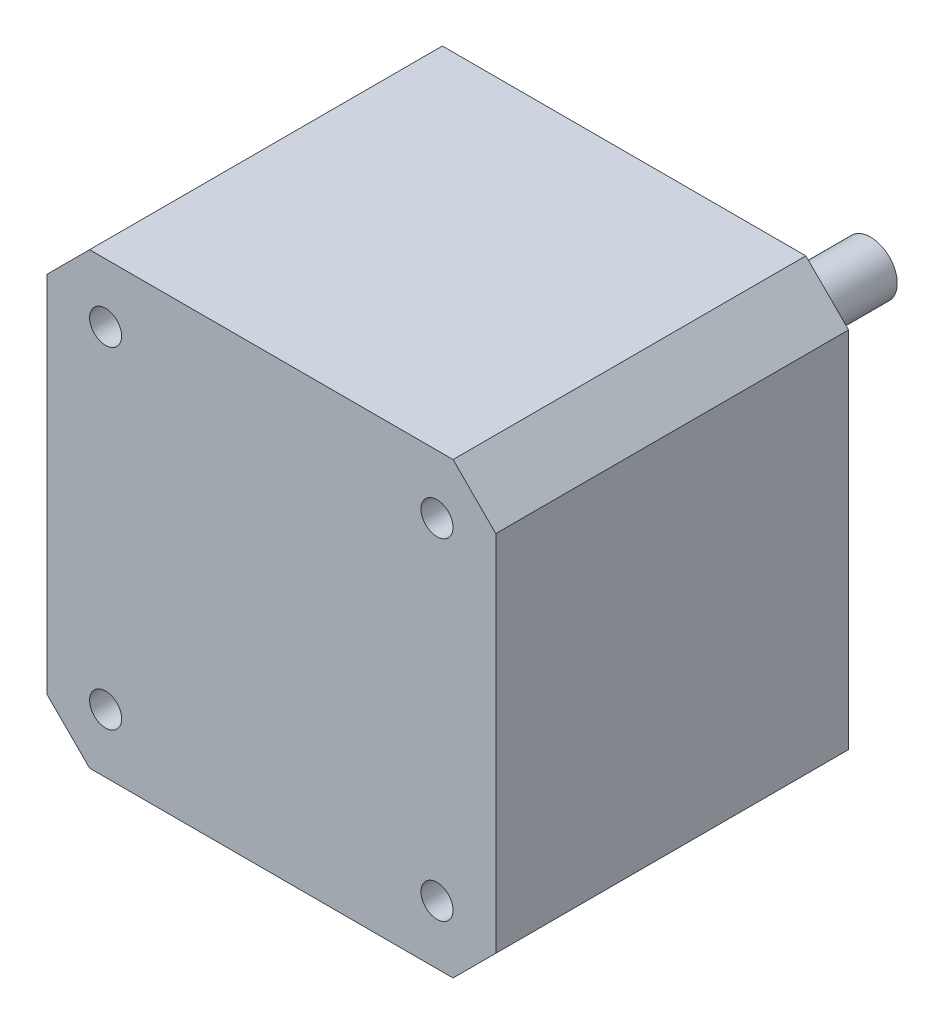
ISO-10303-21;
HEADER;
FILE_DESCRIPTION(('STEP AP214'),'2;1');
FILE_NAME('part.step','',(''),(''),'','','');
FILE_SCHEMA(('AUTOMOTIVE_DESIGN { 1 0 10303 214 1 1 1 1 }'));
ENDSEC;
DATA;
#1=APPLICATION_CONTEXT('core data for automotive mechanical design processes');
#2=APPLICATION_PROTOCOL_DEFINITION('international standard','automotive_design',2000,#1);
#3=PRODUCT_CONTEXT('',#1,'mechanical');
#4=PRODUCT('Part','Part','',(#3));
#5=PRODUCT_RELATED_PRODUCT_CATEGORY('part','',(#4));
#6=PRODUCT_DEFINITION_FORMATION('','',#4);
#7=PRODUCT_DEFINITION_CONTEXT('part definition',#1,'design');
#8=PRODUCT_DEFINITION('design','',#6,#7);
#9=PRODUCT_DEFINITION_SHAPE('','',#8);
#10=(LENGTH_UNIT() NAMED_UNIT(*) SI_UNIT(.MILLI.,.METRE.));
#11=(NAMED_UNIT(*) PLANE_ANGLE_UNIT() SI_UNIT($,.RADIAN.));
#12=(NAMED_UNIT(*) SI_UNIT($,.STERADIAN.) SOLID_ANGLE_UNIT());
#13=UNCERTAINTY_MEASURE_WITH_UNIT(LENGTH_MEASURE(1.E-05),#10,'distance_accuracy_value','');
#14=(GEOMETRIC_REPRESENTATION_CONTEXT(3) GLOBAL_UNCERTAINTY_ASSIGNED_CONTEXT((#13)) GLOBAL_UNIT_ASSIGNED_CONTEXT((#10,
#11,#12)) REPRESENTATION_CONTEXT('',''));
#15=CARTESIAN_POINT('',(0.,0.,0.));
#16=DIRECTION('',(0.,0.,1.));
#17=DIRECTION('',(1.,0.,0.));
#18=AXIS2_PLACEMENT_3D('',#15,#16,#17);
#19=CARTESIAN_POINT('',(0.,0.,-1.3));
#20=DIRECTION('',(0.,0.,-1.));
#21=DIRECTION('',(-1.,0.,0.));
#22=AXIS2_PLACEMENT_3D('',#19,#20,#21);
#23=PLANE('',#22);
#24=CARTESIAN_POINT('',(0.,0.,-1.3));
#25=DIRECTION('',(0.,0.,-1.));
#26=DIRECTION('',(-1.,0.,0.));
#27=AXIS2_PLACEMENT_3D('',#24,#25,#26);
#28=CIRCLE('',#27,11.);
#29=CARTESIAN_POINT('',(-11.,0.,-1.3));
#30=VERTEX_POINT('',#29);
#31=EDGE_CURVE('E159',#30,#30,#28,.T.);
#32=ORIENTED_EDGE('',*,*,#31,.T.);
#33=EDGE_LOOP('',(#32));
#34=FACE_BOUND('',#33,.T.);
#35=CARTESIAN_POINT('',(0.,0.,-1.3));
#36=DIRECTION('',(0.,0.,-1.));
#37=DIRECTION('',(-1.,0.,0.));
#38=AXIS2_PLACEMENT_3D('',#35,#36,#37);
#39=CIRCLE('',#38,2.5);
#40=CARTESIAN_POINT('',(-2.5,0.,-1.3));
#41=VERTEX_POINT('',#40);
#42=EDGE_CURVE('E173',#41,#41,#39,.T.);
#43=ORIENTED_EDGE('',*,*,#42,.F.);
#44=EDGE_LOOP('',(#43));
#45=FACE_BOUND('',#44,.T.);
#46=ADVANCED_FACE('F32',(#34,#45),#23,.T.);
#47=CARTESIAN_POINT('',(0.,0.,0.));
#48=DIRECTION('',(0.,0.,-1.));
#49=DIRECTION('',(-1.,0.,0.));
#50=AXIS2_PLACEMENT_3D('',#47,#48,#49);
#51=PLANE('',#50);
#52=CARTESIAN_POINT('',(-15.5,-15.5,0.));
#53=DIRECTION('',(0.,0.,-1.));
#54=DIRECTION('',(1.,0.,0.));
#55=AXIS2_PLACEMENT_3D('',#52,#53,#54);
#56=CIRCLE('',#55,1.5);
#57=CARTESIAN_POINT('',(-14.,-15.5,0.));
#58=VERTEX_POINT('',#57);
#59=EDGE_CURVE('E197',#58,#58,#56,.T.);
#60=ORIENTED_EDGE('',*,*,#59,.F.);
#61=EDGE_LOOP('',(#60));
#62=FACE_BOUND('',#61,.T.);
#63=CARTESIAN_POINT('',(15.5,-15.5,0.));
#64=DIRECTION('',(0.,0.,-1.));
#65=DIRECTION('',(-1.,0.,0.));
#66=AXIS2_PLACEMENT_3D('',#63,#64,#65);
#67=CIRCLE('',#66,1.5);
#68=CARTESIAN_POINT('',(14.,-15.5,0.));
#69=VERTEX_POINT('',#68);
#70=EDGE_CURVE('E191',#69,#69,#67,.T.);
#71=ORIENTED_EDGE('',*,*,#70,.F.);
#72=EDGE_LOOP('',(#71));
#73=FACE_BOUND('',#72,.T.);
#74=CARTESIAN_POINT('',(15.5,15.5,0.));
#75=DIRECTION('',(0.,0.,-1.));
#76=DIRECTION('',(1.,0.,0.));
#77=AXIS2_PLACEMENT_3D('',#74,#75,#76);
#78=CIRCLE('',#77,1.5);
#79=CARTESIAN_POINT('',(17.,15.5,0.));
#80=VERTEX_POINT('',#79);
#81=EDGE_CURVE('E185',#80,#80,#78,.T.);
#82=ORIENTED_EDGE('',*,*,#81,.F.);
#83=EDGE_LOOP('',(#82));
#84=FACE_BOUND('',#83,.T.);
#85=CARTESIAN_POINT('',(-15.5,15.5,0.));
#86=DIRECTION('',(0.,0.,-1.));
#87=DIRECTION('',(-1.,0.,0.));
#88=AXIS2_PLACEMENT_3D('',#85,#86,#87);
#89=CIRCLE('',#88,1.5);
#90=CARTESIAN_POINT('',(-17.,15.5,0.));
#91=VERTEX_POINT('',#90);
#92=EDGE_CURVE('E179',#91,#91,#89,.T.);
#93=ORIENTED_EDGE('',*,*,#92,.F.);
#94=EDGE_LOOP('',(#93));
#95=FACE_BOUND('',#94,.T.);
#96=DIRECTION('',(1.,0.,0.));
#97=VECTOR('',#96,1.);
#98=CARTESIAN_POINT('',(-21.,-21.,0.));
#99=LINE('',#98,#97);
#100=CARTESIAN_POINT('',(-17.,-21.,0.));
#101=VERTEX_POINT('',#100);
#102=CARTESIAN_POINT('',(17.,-21.,0.));
#103=VERTEX_POINT('',#102);
#104=EDGE_CURVE('E114',#101,#103,#99,.T.);
#105=ORIENTED_EDGE('',*,*,#104,.F.);
#106=DIRECTION('',(0.707106781186546,-0.707106781186549,0.));
#107=VECTOR('',#106,1.);
#108=CARTESIAN_POINT('',(-19.,-19.,0.));
#109=LINE('',#108,#107);
#110=CARTESIAN_POINT('',(-21.,-17.,0.));
#111=VERTEX_POINT('',#110);
#112=EDGE_CURVE('E97',#101,#111,#109,.F.);
#113=ORIENTED_EDGE('',*,*,#112,.T.);
#114=DIRECTION('',(0.,-1.,0.));
#115=VECTOR('',#114,1.);
#116=CARTESIAN_POINT('',(-21.,-21.,0.));
#117=LINE('',#116,#115);
#118=CARTESIAN_POINT('',(-21.,17.,0.));
#119=VERTEX_POINT('',#118);
#120=EDGE_CURVE('E125',#119,#111,#117,.T.);
#121=ORIENTED_EDGE('',*,*,#120,.F.);
#122=DIRECTION('',(-0.707106781186549,-0.707106781186546,0.));
#123=VECTOR('',#122,1.);
#124=CARTESIAN_POINT('',(-19.,19.,0.));
#125=LINE('',#124,#123);
#126=CARTESIAN_POINT('',(-17.,21.,0.));
#127=VERTEX_POINT('',#126);
#128=EDGE_CURVE('E135',#119,#127,#125,.F.);
#129=ORIENTED_EDGE('',*,*,#128,.T.);
#130=DIRECTION('',(-1.,0.,0.));
#131=VECTOR('',#130,1.);
#132=CARTESIAN_POINT('',(-21.,21.,0.));
#133=LINE('',#132,#131);
#134=CARTESIAN_POINT('',(17.,21.,0.));
#135=VERTEX_POINT('',#134);
#136=EDGE_CURVE('E129',#135,#127,#133,.T.);
#137=ORIENTED_EDGE('',*,*,#136,.F.);
#138=DIRECTION('',(-0.707106781186546,0.707106781186549,0.));
#139=VECTOR('',#138,1.);
#140=CARTESIAN_POINT('',(19.,19.,0.));
#141=LINE('',#140,#139);
#142=CARTESIAN_POINT('',(21.,17.,0.));
#143=VERTEX_POINT('',#142);
#144=EDGE_CURVE('E118',#135,#143,#141,.F.);
#145=ORIENTED_EDGE('',*,*,#144,.T.);
#146=DIRECTION('',(0.,1.,0.));
#147=VECTOR('',#146,1.);
#148=CARTESIAN_POINT('',(21.,-21.,0.));
#149=LINE('',#148,#147);
#150=CARTESIAN_POINT('',(21.,-17.,0.));
#151=VERTEX_POINT('',#150);
#152=EDGE_CURVE('E158',#151,#143,#149,.T.);
#153=ORIENTED_EDGE('',*,*,#152,.F.);
#154=DIRECTION('',(0.707106781186549,0.707106781186546,0.));
#155=VECTOR('',#154,1.);
#156=CARTESIAN_POINT('',(19.,-19.,0.));
#157=LINE('',#156,#155);
#158=EDGE_CURVE('E108',#151,#103,#157,.F.);
#159=ORIENTED_EDGE('',*,*,#158,.T.);
#160=EDGE_LOOP('',(#105,#113,#121,#129,#137,#145,#153,#159));
#161=FACE_BOUND('',#160,.T.);
#162=CARTESIAN_POINT('',(0.,0.,0.));
#163=DIRECTION('',(0.,0.,-1.));
#164=DIRECTION('',(-1.,0.,0.));
#165=AXIS2_PLACEMENT_3D('',#162,#163,#164);
#166=CIRCLE('',#165,11.);
#167=CARTESIAN_POINT('',(-11.,0.,0.));
#168=VERTEX_POINT('',#167);
#169=EDGE_CURVE('E167',#168,#168,#166,.T.);
#170=ORIENTED_EDGE('',*,*,#169,.F.);
#171=EDGE_LOOP('',(#170));
#172=FACE_BOUND('',#171,.T.);
#173=ADVANCED_FACE('F121',(#62,#73,#84,#95,#161,#172),#51,.T.);
#174=CARTESIAN_POINT('',(21.,-21.,33.));
#175=DIRECTION('',(-1.,0.,0.));
#176=DIRECTION('',(0.,0.,1.));
#177=AXIS2_PLACEMENT_3D('',#174,#175,#176);
#178=PLANE('',#177);
#179=DIRECTION('',(0.,1.,0.));
#180=VECTOR('',#179,1.);
#181=CARTESIAN_POINT('',(21.,-21.,33.));
#182=LINE('',#181,#180);
#183=CARTESIAN_POINT('',(21.,-17.,33.));
#184=VERTEX_POINT('',#183);
#185=CARTESIAN_POINT('',(21.,17.,33.));
#186=VERTEX_POINT('',#185);
#187=EDGE_CURVE('E124',#184,#186,#182,.T.);
#188=ORIENTED_EDGE('',*,*,#187,.F.);
#189=DIRECTION('',(0.,0.,-1.));
#190=VECTOR('',#189,1.);
#191=CARTESIAN_POINT('',(21.,-17.,33.));
#192=LINE('',#191,#190);
#193=EDGE_CURVE('E150',#184,#151,#192,.T.);
#194=ORIENTED_EDGE('',*,*,#193,.T.);
#195=ORIENTED_EDGE('',*,*,#152,.T.);
#196=DIRECTION('',(0.,0.,1.));
#197=VECTOR('',#196,1.);
#198=CARTESIAN_POINT('',(21.,17.,33.));
#199=LINE('',#198,#197);
#200=EDGE_CURVE('E148',#143,#186,#199,.T.);
#201=ORIENTED_EDGE('',*,*,#200,.T.);
#202=EDGE_LOOP('',(#188,#194,#195,#201));
#203=FACE_BOUND('',#202,.T.);
#204=ADVANCED_FACE('F215',(#203),#178,.F.);
#205=CARTESIAN_POINT('',(-21.,21.,33.));
#206=DIRECTION('',(0.,-1.,0.));
#207=DIRECTION('',(0.,0.,-1.));
#208=AXIS2_PLACEMENT_3D('',#205,#206,#207);
#209=PLANE('',#208);
#210=ORIENTED_EDGE('',*,*,#136,.T.);
#211=DIRECTION('',(0.,0.,1.));
#212=VECTOR('',#211,1.);
#213=CARTESIAN_POINT('',(-17.,21.,33.));
#214=LINE('',#213,#212);
#215=CARTESIAN_POINT('',(-17.,21.,33.));
#216=VERTEX_POINT('',#215);
#217=EDGE_CURVE('E11',#127,#216,#214,.T.);
#218=ORIENTED_EDGE('',*,*,#217,.T.);
#219=DIRECTION('',(-1.,0.,0.));
#220=VECTOR('',#219,1.);
#221=CARTESIAN_POINT('',(-21.,21.,33.));
#222=LINE('',#221,#220);
#223=CARTESIAN_POINT('',(17.,21.,33.));
#224=VERTEX_POINT('',#223);
#225=EDGE_CURVE('E127',#224,#216,#222,.T.);
#226=ORIENTED_EDGE('',*,*,#225,.F.);
#227=DIRECTION('',(0.,0.,-1.));
#228=VECTOR('',#227,1.);
#229=CARTESIAN_POINT('',(17.,21.,33.));
#230=LINE('',#229,#228);
#231=EDGE_CURVE('E40',#224,#135,#230,.T.);
#232=ORIENTED_EDGE('',*,*,#231,.T.);
#233=EDGE_LOOP('',(#210,#218,#226,#232));
#234=FACE_BOUND('',#233,.T.);
#235=ADVANCED_FACE('F155',(#234),#209,.F.);
#236=CARTESIAN_POINT('',(-21.,-21.,33.));
#237=DIRECTION('',(1.,0.,0.));
#238=DIRECTION('',(0.,0.,-1.));
#239=AXIS2_PLACEMENT_3D('',#236,#237,#238);
#240=PLANE('',#239);
#241=ORIENTED_EDGE('',*,*,#120,.T.);
#242=DIRECTION('',(0.,0.,1.));
#243=VECTOR('',#242,1.);
#244=CARTESIAN_POINT('',(-21.,-17.,33.));
#245=LINE('',#244,#243);
#246=CARTESIAN_POINT('',(-21.,-17.,33.));
#247=VERTEX_POINT('',#246);
#248=EDGE_CURVE('E102',#111,#247,#245,.T.);
#249=ORIENTED_EDGE('',*,*,#248,.T.);
#250=DIRECTION('',(0.,-1.,0.));
#251=VECTOR('',#250,1.);
#252=CARTESIAN_POINT('',(-21.,-21.,33.));
#253=LINE('',#252,#251);
#254=CARTESIAN_POINT('',(-21.,17.,33.));
#255=VERTEX_POINT('',#254);
#256=EDGE_CURVE('E163',#255,#247,#253,.T.);
#257=ORIENTED_EDGE('',*,*,#256,.F.);
#258=DIRECTION('',(0.,0.,-1.));
#259=VECTOR('',#258,1.);
#260=CARTESIAN_POINT('',(-21.,17.,33.));
#261=LINE('',#260,#259);
#262=EDGE_CURVE('E107',#255,#119,#261,.T.);
#263=ORIENTED_EDGE('',*,*,#262,.T.);
#264=EDGE_LOOP('',(#241,#249,#257,#263));
#265=FACE_BOUND('',#264,.T.);
#266=ADVANCED_FACE('F255',(#265),#240,.F.);
#267=CARTESIAN_POINT('',(-21.,-21.,33.));
#268=DIRECTION('',(0.,1.,0.));
#269=DIRECTION('',(0.,0.,1.));
#270=AXIS2_PLACEMENT_3D('',#267,#268,#269);
#271=PLANE('',#270);
#272=DIRECTION('',(1.,0.,0.));
#273=VECTOR('',#272,1.);
#274=CARTESIAN_POINT('',(-21.,-21.,33.));
#275=LINE('',#274,#273);
#276=CARTESIAN_POINT('',(-17.,-21.,33.));
#277=VERTEX_POINT('',#276);
#278=CARTESIAN_POINT('',(17.,-21.,33.));
#279=VERTEX_POINT('',#278);
#280=EDGE_CURVE('E117',#277,#279,#275,.T.);
#281=ORIENTED_EDGE('',*,*,#280,.F.);
#282=DIRECTION('',(0.,0.,-1.));
#283=VECTOR('',#282,1.);
#284=CARTESIAN_POINT('',(-17.,-21.,33.));
#285=LINE('',#284,#283);
#286=EDGE_CURVE('E101',#277,#101,#285,.T.);
#287=ORIENTED_EDGE('',*,*,#286,.T.);
#288=ORIENTED_EDGE('',*,*,#104,.T.);
#289=DIRECTION('',(0.,0.,1.));
#290=VECTOR('',#289,1.);
#291=CARTESIAN_POINT('',(17.,-21.,33.));
#292=LINE('',#291,#290);
#293=EDGE_CURVE('E119',#103,#279,#292,.T.);
#294=ORIENTED_EDGE('',*,*,#293,.T.);
#295=EDGE_LOOP('',(#281,#287,#288,#294));
#296=FACE_BOUND('',#295,.T.);
#297=ADVANCED_FACE('F113',(#296),#271,.F.);
#298=CARTESIAN_POINT('',(0.,0.,33.));
#299=DIRECTION('',(0.,0.,-1.));
#300=DIRECTION('',(-1.,0.,0.));
#301=AXIS2_PLACEMENT_3D('',#298,#299,#300);
#302=PLANE('',#301);
#303=CARTESIAN_POINT('',(-15.5,-15.5,33.));
#304=DIRECTION('',(0.,0.,-1.));
#305=DIRECTION('',(1.,0.,0.));
#306=AXIS2_PLACEMENT_3D('',#303,#304,#305);
#307=CIRCLE('',#306,1.5);
#308=CARTESIAN_POINT('',(-14.,-15.5,33.));
#309=VERTEX_POINT('',#308);
#310=EDGE_CURVE('E194',#309,#309,#307,.T.);
#311=ORIENTED_EDGE('',*,*,#310,.T.);
#312=EDGE_LOOP('',(#311));
#313=FACE_BOUND('',#312,.T.);
#314=CARTESIAN_POINT('',(15.5,-15.5,33.));
#315=DIRECTION('',(0.,0.,-1.));
#316=DIRECTION('',(-1.,0.,0.));
#317=AXIS2_PLACEMENT_3D('',#314,#315,#316);
#318=CIRCLE('',#317,1.5);
#319=CARTESIAN_POINT('',(14.,-15.5,33.));
#320=VERTEX_POINT('',#319);
#321=EDGE_CURVE('E188',#320,#320,#318,.T.);
#322=ORIENTED_EDGE('',*,*,#321,.T.);
#323=EDGE_LOOP('',(#322));
#324=FACE_BOUND('',#323,.T.);
#325=CARTESIAN_POINT('',(15.5,15.5,33.));
#326=DIRECTION('',(0.,0.,-1.));
#327=DIRECTION('',(1.,0.,0.));
#328=AXIS2_PLACEMENT_3D('',#325,#326,#327);
#329=CIRCLE('',#328,1.5);
#330=CARTESIAN_POINT('',(17.,15.5,33.));
#331=VERTEX_POINT('',#330);
#332=EDGE_CURVE('E182',#331,#331,#329,.T.);
#333=ORIENTED_EDGE('',*,*,#332,.T.);
#334=EDGE_LOOP('',(#333));
#335=FACE_BOUND('',#334,.T.);
#336=CARTESIAN_POINT('',(-15.5,15.5,33.));
#337=DIRECTION('',(0.,0.,-1.));
#338=DIRECTION('',(-1.,0.,0.));
#339=AXIS2_PLACEMENT_3D('',#336,#337,#338);
#340=CIRCLE('',#339,1.5);
#341=CARTESIAN_POINT('',(-17.,15.5,33.));
#342=VERTEX_POINT('',#341);
#343=EDGE_CURVE('E176',#342,#342,#340,.T.);
#344=ORIENTED_EDGE('',*,*,#343,.T.);
#345=EDGE_LOOP('',(#344));
#346=FACE_BOUND('',#345,.T.);
#347=ORIENTED_EDGE('',*,*,#256,.T.);
#348=DIRECTION('',(-0.707106781186546,0.707106781186549,0.));
#349=VECTOR('',#348,1.);
#350=CARTESIAN_POINT('',(-17.,-21.,33.));
#351=LINE('',#350,#349);
#352=EDGE_CURVE('E146',#247,#277,#351,.F.);
#353=ORIENTED_EDGE('',*,*,#352,.T.);
#354=ORIENTED_EDGE('',*,*,#280,.T.);
#355=DIRECTION('',(-0.707106781186549,-0.707106781186546,0.));
#356=VECTOR('',#355,1.);
#357=CARTESIAN_POINT('',(21.,-17.,33.));
#358=LINE('',#357,#356);
#359=EDGE_CURVE('E144',#279,#184,#358,.F.);
#360=ORIENTED_EDGE('',*,*,#359,.T.);
#361=ORIENTED_EDGE('',*,*,#187,.T.);
#362=DIRECTION('',(0.707106781186546,-0.707106781186549,0.));
#363=VECTOR('',#362,1.);
#364=CARTESIAN_POINT('',(17.,21.,33.));
#365=LINE('',#364,#363);
#366=EDGE_CURVE('E52',#186,#224,#365,.F.);
#367=ORIENTED_EDGE('',*,*,#366,.T.);
#368=ORIENTED_EDGE('',*,*,#225,.T.);
#369=DIRECTION('',(0.707106781186549,0.707106781186546,0.));
#370=VECTOR('',#369,1.);
#371=CARTESIAN_POINT('',(-21.,17.,33.));
#372=LINE('',#371,#370);
#373=EDGE_CURVE('E142',#216,#255,#372,.F.);
#374=ORIENTED_EDGE('',*,*,#373,.T.);
#375=EDGE_LOOP('',(#347,#353,#354,#360,#361,#367,#368,#374));
#376=FACE_BOUND('',#375,.T.);
#377=ADVANCED_FACE('F203',(#313,#324,#335,#346,#376),#302,.F.);
#378=CARTESIAN_POINT('',(-17.,-21.,33.));
#379=DIRECTION('',(0.707106781186549,0.707106781186546,0.));
#380=DIRECTION('',(0.,0.,-1.));
#381=AXIS2_PLACEMENT_3D('',#378,#379,#380);
#382=PLANE('',#381);
#383=ORIENTED_EDGE('',*,*,#352,.F.);
#384=ORIENTED_EDGE('',*,*,#248,.F.);
#385=ORIENTED_EDGE('',*,*,#112,.F.);
#386=ORIENTED_EDGE('',*,*,#286,.F.);
#387=EDGE_LOOP('',(#383,#384,#385,#386));
#388=FACE_BOUND('',#387,.T.);
#389=ADVANCED_FACE('F100',(#388),#382,.F.);
#390=CARTESIAN_POINT('',(21.,-17.,33.));
#391=DIRECTION('',(-0.707106781186546,0.707106781186549,0.));
#392=DIRECTION('',(0.,0.,-1.));
#393=AXIS2_PLACEMENT_3D('',#390,#391,#392);
#394=PLANE('',#393);
#395=ORIENTED_EDGE('',*,*,#359,.F.);
#396=ORIENTED_EDGE('',*,*,#293,.F.);
#397=ORIENTED_EDGE('',*,*,#158,.F.);
#398=ORIENTED_EDGE('',*,*,#193,.F.);
#399=EDGE_LOOP('',(#395,#396,#397,#398));
#400=FACE_BOUND('',#399,.T.);
#401=ADVANCED_FACE('F266',(#400),#394,.F.);
#402=CARTESIAN_POINT('',(-21.,17.,33.));
#403=DIRECTION('',(0.707106781186546,-0.707106781186549,0.));
#404=DIRECTION('',(0.,0.,-1.));
#405=AXIS2_PLACEMENT_3D('',#402,#403,#404);
#406=PLANE('',#405);
#407=ORIENTED_EDGE('',*,*,#373,.F.);
#408=ORIENTED_EDGE('',*,*,#217,.F.);
#409=ORIENTED_EDGE('',*,*,#128,.F.);
#410=ORIENTED_EDGE('',*,*,#262,.F.);
#411=EDGE_LOOP('',(#407,#408,#409,#410));
#412=FACE_BOUND('',#411,.T.);
#413=ADVANCED_FACE('F268',(#412),#406,.F.);
#414=CARTESIAN_POINT('',(17.,21.,33.));
#415=DIRECTION('',(-0.707106781186549,-0.707106781186546,0.));
#416=DIRECTION('',(0.,0.,-1.));
#417=AXIS2_PLACEMENT_3D('',#414,#415,#416);
#418=PLANE('',#417);
#419=ORIENTED_EDGE('',*,*,#366,.F.);
#420=ORIENTED_EDGE('',*,*,#200,.F.);
#421=ORIENTED_EDGE('',*,*,#144,.F.);
#422=ORIENTED_EDGE('',*,*,#231,.F.);
#423=EDGE_LOOP('',(#419,#420,#421,#422));
#424=FACE_BOUND('',#423,.T.);
#425=ADVANCED_FACE('F34',(#424),#418,.F.);
#426=CARTESIAN_POINT('',(0.,0.,-1.3));
#427=DIRECTION('',(0.,0.,1.));
#428=DIRECTION('',(1.,0.,0.));
#429=AXIS2_PLACEMENT_3D('',#426,#427,#428);
#430=CYLINDRICAL_SURFACE('',#429,11.);
#431=ORIENTED_EDGE('',*,*,#31,.F.);
#432=EDGE_LOOP('',(#431));
#433=FACE_BOUND('',#432,.T.);
#434=ORIENTED_EDGE('',*,*,#169,.T.);
#435=EDGE_LOOP('',(#434));
#436=FACE_BOUND('',#435,.T.);
#437=ADVANCED_FACE('F247',(#433,#436),#430,.T.);
#438=CARTESIAN_POINT('',(0.,0.,-23.05));
#439=DIRECTION('',(0.,0.,1.));
#440=DIRECTION('',(1.,0.,0.));
#441=AXIS2_PLACEMENT_3D('',#438,#439,#440);
#442=CYLINDRICAL_SURFACE('',#441,2.5);
#443=CARTESIAN_POINT('',(0.,0.,-23.05));
#444=DIRECTION('',(0.,0.,-1.));
#445=DIRECTION('',(-1.,0.,0.));
#446=AXIS2_PLACEMENT_3D('',#443,#444,#445);
#447=CIRCLE('',#446,2.5);
#448=CARTESIAN_POINT('',(-2.5,0.,-23.05));
#449=VERTEX_POINT('',#448);
#450=EDGE_CURVE('E170',#449,#449,#447,.T.);
#451=ORIENTED_EDGE('',*,*,#450,.F.);
#452=EDGE_LOOP('',(#451));
#453=FACE_BOUND('',#452,.T.);
#454=ORIENTED_EDGE('',*,*,#42,.T.);
#455=EDGE_LOOP('',(#454));
#456=FACE_BOUND('',#455,.T.);
#457=ADVANCED_FACE('F235',(#453,#456),#442,.T.);
#458=CARTESIAN_POINT('',(0.,0.,-23.05));
#459=DIRECTION('',(0.,0.,-1.));
#460=DIRECTION('',(-1.,0.,0.));
#461=AXIS2_PLACEMENT_3D('',#458,#459,#460);
#462=PLANE('',#461);
#463=ORIENTED_EDGE('',*,*,#450,.T.);
#464=EDGE_LOOP('',(#463));
#465=FACE_BOUND('',#464,.T.);
#466=ADVANCED_FACE('F226',(#465),#462,.T.);
#467=CARTESIAN_POINT('',(-15.5,15.5,33.));
#468=DIRECTION('',(0.,0.,-1.));
#469=DIRECTION('',(-1.,0.,0.));
#470=AXIS2_PLACEMENT_3D('',#467,#468,#469);
#471=CYLINDRICAL_SURFACE('',#470,1.5);
#472=ORIENTED_EDGE('',*,*,#343,.F.);
#473=EDGE_LOOP('',(#472));
#474=FACE_BOUND('',#473,.T.);
#475=ORIENTED_EDGE('',*,*,#92,.T.);
#476=EDGE_LOOP('',(#475));
#477=FACE_BOUND('',#476,.T.);
#478=ADVANCED_FACE('F223',(#474,#477),#471,.F.);
#479=CARTESIAN_POINT('',(15.5,15.5,33.));
#480=DIRECTION('',(0.,0.,-1.));
#481=DIRECTION('',(-1.,0.,0.));
#482=AXIS2_PLACEMENT_3D('',#479,#480,#481);
#483=CYLINDRICAL_SURFACE('',#482,1.5);
#484=ORIENTED_EDGE('',*,*,#332,.F.);
#485=EDGE_LOOP('',(#484));
#486=FACE_BOUND('',#485,.T.);
#487=ORIENTED_EDGE('',*,*,#81,.T.);
#488=EDGE_LOOP('',(#487));
#489=FACE_BOUND('',#488,.T.);
#490=ADVANCED_FACE('F225',(#486,#489),#483,.F.);
#491=CARTESIAN_POINT('',(15.5,-15.5,33.));
#492=DIRECTION('',(0.,0.,-1.));
#493=DIRECTION('',(-1.,0.,0.));
#494=AXIS2_PLACEMENT_3D('',#491,#492,#493);
#495=CYLINDRICAL_SURFACE('',#494,1.5);
#496=ORIENTED_EDGE('',*,*,#321,.F.);
#497=EDGE_LOOP('',(#496));
#498=FACE_BOUND('',#497,.T.);
#499=ORIENTED_EDGE('',*,*,#70,.T.);
#500=EDGE_LOOP('',(#499));
#501=FACE_BOUND('',#500,.T.);
#502=ADVANCED_FACE('F209',(#498,#501),#495,.F.);
#503=CARTESIAN_POINT('',(-15.5,-15.5,33.));
#504=DIRECTION('',(0.,0.,-1.));
#505=DIRECTION('',(-1.,0.,0.));
#506=AXIS2_PLACEMENT_3D('',#503,#504,#505);
#507=CYLINDRICAL_SURFACE('',#506,1.5);
#508=ORIENTED_EDGE('',*,*,#310,.F.);
#509=EDGE_LOOP('',(#508));
#510=FACE_BOUND('',#509,.T.);
#511=ORIENTED_EDGE('',*,*,#59,.T.);
#512=EDGE_LOOP('',(#511));
#513=FACE_BOUND('',#512,.T.);
#514=ADVANCED_FACE('F206',(#510,#513),#507,.F.);
#515=CLOSED_SHELL('',(#46,#173,#204,#235,#266,#297,#377,#389,#401,#413,#425,#437,#457,#466,#478,
#490,#502,#514));
#516=MANIFOLD_SOLID_BREP('B2',#515);
#517=ADVANCED_BREP_SHAPE_REPRESENTATION('',(#18,#516),#14);
#518=SHAPE_DEFINITION_REPRESENTATION(#9,#517);
ENDSEC;
END-ISO-10303-21;
